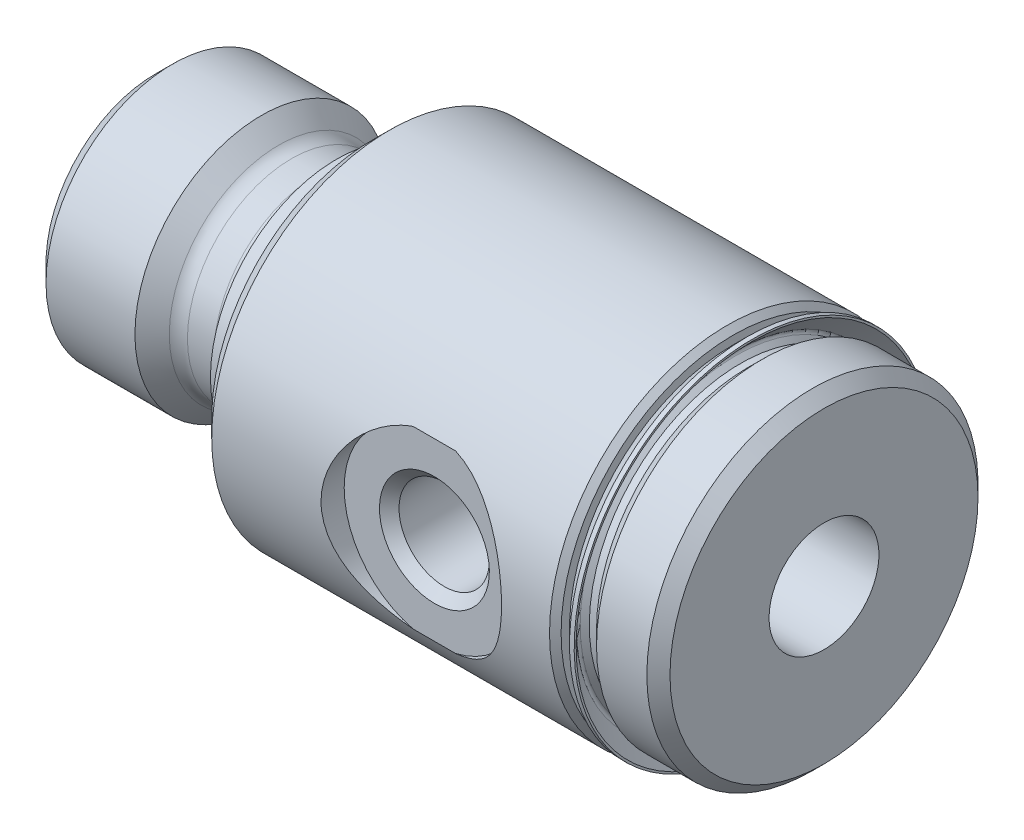
ISO-10303-21;
HEADER;
FILE_DESCRIPTION(('STEP AP214'),'2;1');
FILE_NAME('part.step','',(''),(''),'','','');
FILE_SCHEMA(('AUTOMOTIVE_DESIGN { 1 0 10303 214 1 1 1 1 }'));
ENDSEC;
DATA;
#1=APPLICATION_CONTEXT('core data for automotive mechanical design processes');
#2=APPLICATION_PROTOCOL_DEFINITION('international standard','automotive_design',2000,#1);
#3=PRODUCT_CONTEXT('',#1,'mechanical');
#4=PRODUCT('Part','Part','',(#3));
#5=PRODUCT_RELATED_PRODUCT_CATEGORY('part','',(#4));
#6=PRODUCT_DEFINITION_FORMATION('','',#4);
#7=PRODUCT_DEFINITION_CONTEXT('part definition',#1,'design');
#8=PRODUCT_DEFINITION('design','',#6,#7);
#9=PRODUCT_DEFINITION_SHAPE('','',#8);
#10=(LENGTH_UNIT() NAMED_UNIT(*) SI_UNIT(.MILLI.,.METRE.));
#11=(NAMED_UNIT(*) PLANE_ANGLE_UNIT() SI_UNIT($,.RADIAN.));
#12=(NAMED_UNIT(*) SI_UNIT($,.STERADIAN.) SOLID_ANGLE_UNIT());
#13=UNCERTAINTY_MEASURE_WITH_UNIT(LENGTH_MEASURE(1.E-05),#10,'distance_accuracy_value','');
#14=(GEOMETRIC_REPRESENTATION_CONTEXT(3) GLOBAL_UNCERTAINTY_ASSIGNED_CONTEXT((#13)) GLOBAL_UNIT_ASSIGNED_CONTEXT((#10,
#11,#12)) REPRESENTATION_CONTEXT('',''));
#15=CARTESIAN_POINT('',(0.,0.,0.));
#16=DIRECTION('',(0.,0.,1.));
#17=DIRECTION('',(1.,0.,0.));
#18=AXIS2_PLACEMENT_3D('',#15,#16,#17);
#19=CARTESIAN_POINT('',(29.3624,0.,0.));
#20=DIRECTION('',(-1.,0.,0.));
#21=DIRECTION('',(0.,0.,1.));
#22=AXIS2_PLACEMENT_3D('',#19,#20,#21);
#23=CYLINDRICAL_SURFACE('',#22,6.63575);
#24=CARTESIAN_POINT('',(25.6921000000149,-4.56834570173023E-13,0.));
#25=DIRECTION('',(-1.,0.,0.));
#26=DIRECTION('',(0.,-1.,0.));
#27=AXIS2_PLACEMENT_3D('',#24,#25,#26);
#28=CIRCLE('',#27,6.63574999992943);
#29=CARTESIAN_POINT('',(25.6921000000148,-6.63574999992989,0.));
#30=VERTEX_POINT('',#29);
#31=EDGE_CURVE('E502',#30,#30,#28,.T.);
#32=ORIENTED_EDGE('',*,*,#31,.F.);
#33=EDGE_LOOP('',(#32));
#34=FACE_BOUND('',#33,.T.);
#35=CARTESIAN_POINT('',(26.0095999999521,0.,0.));
#36=DIRECTION('',(1.,0.,0.));
#37=DIRECTION('',(0.,0.,-1.));
#38=AXIS2_PLACEMENT_3D('',#35,#36,#37);
#39=CIRCLE('',#38,6.63574999998673);
#40=CARTESIAN_POINT('',(26.0095999999521,0.,-6.63574999998673));
#41=VERTEX_POINT('',#40);
#42=EDGE_CURVE('E505',#41,#41,#39,.T.);
#43=ORIENTED_EDGE('',*,*,#42,.F.);
#44=EDGE_LOOP('',(#43));
#45=FACE_BOUND('',#44,.T.);
#46=ADVANCED_FACE('F17',(#34,#45),#23,.T.);
#47=CARTESIAN_POINT('',(25.4916397552166,-4.53196508098941E-13,0.));
#48=DIRECTION('',(-1.,0.,0.));
#49=DIRECTION('',(0.,-1.,0.));
#50=AXIS2_PLACEMENT_3D('',#47,#48,#49);
#51=CONICAL_SURFACE('',#50,6.83621024472768,0.785398163397468);
#52=ORIENTED_EDGE('',*,*,#31,.T.);
#53=EDGE_LOOP('',(#52));
#54=FACE_BOUND('',#53,.T.);
#55=CARTESIAN_POINT('',(25.4916397551572,-4.529023367679E-13,0.));
#56=DIRECTION('',(1.,0.,0.));
#57=DIRECTION('',(0.,1.,0.));
#58=AXIS2_PLACEMENT_3D('',#55,#56,#57);
#59=CIRCLE('',#58,6.83621024484324);
#60=CARTESIAN_POINT('',(25.4916397551573,6.83621024484279,0.));
#61=VERTEX_POINT('',#60);
#62=EDGE_CURVE('E509',#61,#61,#59,.T.);
#63=ORIENTED_EDGE('',*,*,#62,.T.);
#64=EDGE_LOOP('',(#63));
#65=FACE_BOUND('',#64,.T.);
#66=ADVANCED_FACE('F427',(#54,#65),#51,.T.);
#67=CARTESIAN_POINT('',(4.66029386444688,0.,0.));
#68=DIRECTION('',(-1.,0.,0.));
#69=DIRECTION('',(0.,0.,1.));
#70=AXIS2_PLACEMENT_3D('',#67,#68,#69);
#71=CONICAL_SURFACE('',#70,5.55624999992688,0.781588524280891);
#72=CARTESIAN_POINT('',(4.66029386437265,0.,0.));
#73=DIRECTION('',(-1.,0.,0.));
#74=DIRECTION('',(0.,0.,1.));
#75=AXIS2_PLACEMENT_3D('',#72,#73,#74);
#76=CIRCLE('',#75,5.55625);
#77=CARTESIAN_POINT('',(4.66029386437265,0.,5.55625));
#78=VERTEX_POINT('',#77);
#79=EDGE_CURVE('E506',#78,#78,#76,.T.);
#80=ORIENTED_EDGE('',*,*,#79,.F.);
#81=EDGE_LOOP('',(#80));
#82=FACE_BOUND('',#81,.T.);
#83=CARTESIAN_POINT('',(5.41810329137176,0.,0.));
#84=DIRECTION('',(1.,0.,0.));
#85=DIRECTION('',(0.,0.,-1.));
#86=AXIS2_PLACEMENT_3D('',#83,#84,#85);
#87=CIRCLE('',#86,4.80419264838054);
#88=CARTESIAN_POINT('',(5.41810329137176,0.,-4.80419264838054));
#89=VERTEX_POINT('',#88);
#90=EDGE_CURVE('E520',#89,#89,#87,.F.);
#91=ORIENTED_EDGE('',*,*,#90,.T.);
#92=EDGE_LOOP('',(#91));
#93=FACE_BOUND('',#92,.T.);
#94=ADVANCED_FACE('F417',(#82,#93),#71,.T.);
#95=CARTESIAN_POINT('',(26.6445999999974,0.,0.));
#96=DIRECTION('',(1.,0.,0.));
#97=DIRECTION('',(0.,0.,-1.));
#98=AXIS2_PLACEMENT_3D('',#95,#96,#97);
#99=CONICAL_SURFACE('',#98,7.27075000003197,0.785398163442207);
#100=ORIENTED_EDGE('',*,*,#42,.T.);
#101=EDGE_LOOP('',(#100));
#102=FACE_BOUND('',#101,.T.);
#103=CARTESIAN_POINT('',(26.6446,0.,0.));
#104=DIRECTION('',(-1.,0.,0.));
#105=DIRECTION('',(0.,0.,1.));
#106=AXIS2_PLACEMENT_3D('',#103,#104,#105);
#107=CIRCLE('',#106,7.27075);
#108=CARTESIAN_POINT('',(26.6446,0.,7.27075));
#109=VERTEX_POINT('',#108);
#110=EDGE_CURVE('E531',#109,#109,#107,.F.);
#111=ORIENTED_EDGE('',*,*,#110,.F.);
#112=EDGE_LOOP('',(#111));
#113=FACE_BOUND('',#112,.T.);
#114=ADVANCED_FACE('F407',(#102,#113),#99,.T.);
#115=CARTESIAN_POINT('',(9.525,0.,0.));
#116=DIRECTION('',(-1.,0.,0.));
#117=DIRECTION('',(0.,0.,1.));
#118=AXIS2_PLACEMENT_3D('',#115,#116,#117);
#119=CYLINDRICAL_SURFACE('',#118,5.55625);
#120=CARTESIAN_POINT('',(0.755649999973684,0.,0.));
#121=DIRECTION('',(1.,0.,0.));
#122=DIRECTION('',(0.,0.,-1.));
#123=AXIS2_PLACEMENT_3D('',#120,#121,#122);
#124=CIRCLE('',#123,5.55624999992688);
#125=CARTESIAN_POINT('',(0.755649999973684,0.,-5.55624999992688));
#126=VERTEX_POINT('',#125);
#127=EDGE_CURVE('E535',#126,#126,#124,.F.);
#128=ORIENTED_EDGE('',*,*,#127,.F.);
#129=EDGE_LOOP('',(#128));
#130=FACE_BOUND('',#129,.T.);
#131=ORIENTED_EDGE('',*,*,#79,.T.);
#132=EDGE_LOOP('',(#131));
#133=FACE_BOUND('',#132,.T.);
#134=ADVANCED_FACE('F397',(#130,#133),#119,.T.);
#135=CARTESIAN_POINT('',(25.5814423163679,-4.54497550705923E-13,0.));
#136=DIRECTION('',(1.,0.,0.));
#137=DIRECTION('',(0.,1.,0.));
#138=AXIS2_PLACEMENT_3D('',#135,#136,#137);
#139=TOROIDAL_SURFACE('',#138,6.9260128060539,0.126999999999996);
#140=CARTESIAN_POINT('',(25.4916397551571,-4.53273680903216E-13,0.));
#141=DIRECTION('',(1.,0.,0.));
#142=DIRECTION('',(0.,1.,0.));
#143=AXIS2_PLACEMENT_3D('',#140,#141,#142);
#144=CIRCLE('',#143,7.01581536726466);
#145=CARTESIAN_POINT('',(25.4916397551572,7.0158153672642,0.));
#146=VERTEX_POINT('',#145);
#147=EDGE_CURVE('E538',#146,#146,#144,.T.);
#148=ORIENTED_EDGE('',*,*,#147,.T.);
#149=EDGE_LOOP('',(#148));
#150=FACE_BOUND('',#149,.T.);
#151=ORIENTED_EDGE('',*,*,#62,.F.);
#152=EDGE_LOOP('',(#151));
#153=FACE_BOUND('',#152,.T.);
#154=ADVANCED_FACE('F387',(#150,#153),#139,.F.);
#155=CARTESIAN_POINT('',(5.9817,0.,0.));
#156=DIRECTION('',(1.,0.,0.));
#157=DIRECTION('',(0.,0.,-1.));
#158=AXIS2_PLACEMENT_3D('',#155,#156,#157);
#159=TOROIDAL_SURFACE('',#158,5.37209999999997,0.800099999999985);
#160=ORIENTED_EDGE('',*,*,#90,.F.);
#161=EDGE_LOOP('',(#160));
#162=FACE_BOUND('',#161,.T.);
#163=CARTESIAN_POINT('',(5.9817,0.,0.));
#164=DIRECTION('',(-1.,0.,0.));
#165=DIRECTION('',(0.,0.,1.));
#166=AXIS2_PLACEMENT_3D('',#163,#164,#165);
#167=CIRCLE('',#166,4.572);
#168=CARTESIAN_POINT('',(5.9817,0.,4.572));
#169=VERTEX_POINT('',#168);
#170=EDGE_CURVE('E547',#169,#169,#167,.F.);
#171=ORIENTED_EDGE('',*,*,#170,.F.);
#172=EDGE_LOOP('',(#171));
#173=FACE_BOUND('',#172,.T.);
#174=ADVANCED_FACE('F377',(#162,#173),#159,.F.);
#175=CARTESIAN_POINT('',(29.3624,0.,0.));
#176=DIRECTION('',(-1.,0.,0.));
#177=DIRECTION('',(0.,0.,1.));
#178=AXIS2_PLACEMENT_3D('',#175,#176,#177);
#179=CYLINDRICAL_SURFACE('',#178,7.27075);
#180=ORIENTED_EDGE('',*,*,#110,.T.);
#181=EDGE_LOOP('',(#180));
#182=FACE_BOUND('',#181,.T.);
#183=CARTESIAN_POINT('',(28.8544,0.,0.));
#184=DIRECTION('',(-1.,0.,0.));
#185=DIRECTION('',(0.,0.,1.));
#186=AXIS2_PLACEMENT_3D('',#183,#184,#185);
#187=CIRCLE('',#186,7.27075);
#188=CARTESIAN_POINT('',(28.8544,0.,7.27075));
#189=VERTEX_POINT('',#188);
#190=EDGE_CURVE('E552',#189,#189,#187,.F.);
#191=ORIENTED_EDGE('',*,*,#190,.F.);
#192=EDGE_LOOP('',(#191));
#193=FACE_BOUND('',#192,.T.);
#194=ADVANCED_FACE('F367',(#182,#193),#179,.T.);
#195=CARTESIAN_POINT('',(0.755649999916841,0.,0.));
#196=DIRECTION('',(1.,0.,0.));
#197=DIRECTION('',(0.,0.,-1.));
#198=AXIS2_PLACEMENT_3D('',#195,#196,#197);
#199=CONICAL_SURFACE('',#198,5.55624999987003,0.785398163435061);
#200=CARTESIAN_POINT('',(5.68435272810253E-11,0.,0.));
#201=DIRECTION('',(1.,0.,0.));
#202=DIRECTION('',(0.,0.,-1.));
#203=AXIS2_PLACEMENT_3D('',#200,#201,#202);
#204=CIRCLE('',#203,4.80059999995319);
#205=CARTESIAN_POINT('',(5.68435272810253E-11,0.,-4.80059999995319));
#206=VERTEX_POINT('',#205);
#207=EDGE_CURVE('E20',#206,#206,#204,.T.);
#208=ORIENTED_EDGE('',*,*,#207,.T.);
#209=EDGE_LOOP('',(#208));
#210=FACE_BOUND('',#209,.T.);
#211=ORIENTED_EDGE('',*,*,#127,.T.);
#212=EDGE_LOOP('',(#211));
#213=FACE_BOUND('',#212,.T.);
#214=ADVANCED_FACE('F357',(#210,#213),#199,.T.);
#215=CARTESIAN_POINT('',(26.2021561920187,-4.65773253299773E-13,0.));
#216=DIRECTION('',(1.,0.,0.));
#217=DIRECTION('',(0.,1.,0.));
#218=AXIS2_PLACEMENT_3D('',#215,#216,#217);
#219=CONICAL_SURFACE('',#218,7.72633180412633,0.785398163397471);
#220=ORIENTED_EDGE('',*,*,#147,.F.);
#221=EDGE_LOOP('',(#220));
#222=FACE_BOUND('',#221,.T.);
#223=CARTESIAN_POINT('',(26.2021561920187,-4.65773253299773E-13,0.));
#224=DIRECTION('',(1.,0.,0.));
#225=DIRECTION('',(0.,1.,0.));
#226=AXIS2_PLACEMENT_3D('',#223,#224,#225);
#227=CIRCLE('',#226,7.72633180412633);
#228=CARTESIAN_POINT('',(26.2021561920188,7.72633180412586,0.));
#229=VERTEX_POINT('',#228);
#230=EDGE_CURVE('E578',#229,#229,#227,.F.);
#231=ORIENTED_EDGE('',*,*,#230,.F.);
#232=EDGE_LOOP('',(#231));
#233=FACE_BOUND('',#232,.T.);
#234=ADVANCED_FACE('F347',(#222,#233),#219,.F.);
#235=CARTESIAN_POINT('',(9.525,0.,0.));
#236=DIRECTION('',(-1.,0.,0.));
#237=DIRECTION('',(0.,0.,1.));
#238=AXIS2_PLACEMENT_3D('',#235,#236,#237);
#239=CYLINDRICAL_SURFACE('',#238,4.572);
#240=ORIENTED_EDGE('',*,*,#170,.T.);
#241=EDGE_LOOP('',(#240));
#242=FACE_BOUND('',#241,.T.);
#243=CARTESIAN_POINT('',(7.1501,0.,0.));
#244=DIRECTION('',(1.,0.,0.));
#245=DIRECTION('',(0.,0.,-1.));
#246=AXIS2_PLACEMENT_3D('',#243,#244,#245);
#247=CIRCLE('',#246,4.572);
#248=CARTESIAN_POINT('',(7.1501,0.,-4.572));
#249=VERTEX_POINT('',#248);
#250=EDGE_CURVE('E575',#249,#249,#247,.F.);
#251=ORIENTED_EDGE('',*,*,#250,.T.);
#252=EDGE_LOOP('',(#251));
#253=FACE_BOUND('',#252,.T.);
#254=ADVANCED_FACE('F337',(#242,#253),#239,.T.);
#255=CARTESIAN_POINT('',(28.8544,0.,0.));
#256=DIRECTION('',(-1.,0.,0.));
#257=DIRECTION('',(0.,-1.,0.));
#258=AXIS2_PLACEMENT_3D('',#255,#256,#257);
#259=CONICAL_SURFACE('',#258,7.27075,0.785398163397447);
#260=ORIENTED_EDGE('',*,*,#190,.T.);
#261=EDGE_LOOP('',(#260));
#262=FACE_BOUND('',#261,.T.);
#263=CARTESIAN_POINT('',(29.3624,0.,0.));
#264=DIRECTION('',(-1.,0.,0.));
#265=DIRECTION('',(0.,-1.,0.));
#266=AXIS2_PLACEMENT_3D('',#263,#264,#265);
#267=CIRCLE('',#266,6.76275);
#268=CARTESIAN_POINT('',(29.3624,-6.76275,0.));
#269=VERTEX_POINT('',#268);
#270=EDGE_CURVE('E577',#269,#269,#267,.T.);
#271=ORIENTED_EDGE('',*,*,#270,.T.);
#272=EDGE_LOOP('',(#271));
#273=FACE_BOUND('',#272,.T.);
#274=ADVANCED_FACE('F327',(#262,#273),#259,.T.);
#275=CARTESIAN_POINT('',(0.,0.,0.));
#276=DIRECTION('',(1.,0.,0.));
#277=DIRECTION('',(0.,0.,-1.));
#278=AXIS2_PLACEMENT_3D('',#275,#276,#277);
#279=PLANE('',#278);
#280=CARTESIAN_POINT('',(-5.6843418860808E-11,0.,0.));
#281=DIRECTION('',(-1.,0.,0.));
#282=DIRECTION('',(0.,0.,1.));
#283=AXIS2_PLACEMENT_3D('',#280,#281,#282);
#284=CIRCLE('',#283,2.92100000001483);
#285=CARTESIAN_POINT('',(-5.6843418860808E-11,0.,2.92100000001483));
#286=VERTEX_POINT('',#285);
#287=EDGE_CURVE('E583',#286,#286,#284,.F.);
#288=ORIENTED_EDGE('',*,*,#287,.T.);
#289=EDGE_LOOP('',(#288));
#290=FACE_BOUND('',#289,.T.);
#291=ORIENTED_EDGE('',*,*,#207,.F.);
#292=EDGE_LOOP('',(#291));
#293=FACE_BOUND('',#292,.T.);
#294=ADVANCED_FACE('F317',(#290,#293),#279,.F.);
#295=CARTESIAN_POINT('',(26.2021561920189,7.72633180412578,0.));
#296=DIRECTION('',(1.,0.,0.));
#297=DIRECTION('',(0.,1.,0.));
#298=AXIS2_PLACEMENT_3D('',#295,#296,#297);
#299=PLANE('',#298);
#300=ORIENTED_EDGE('',*,*,#230,.T.);
#301=EDGE_LOOP('',(#300));
#302=FACE_BOUND('',#301,.T.);
#303=CARTESIAN_POINT('',(26.2021561920188,-4.6589498822447E-13,0.));
#304=DIRECTION('',(-1.,0.,0.));
#305=DIRECTION('',(0.,-1.,0.));
#306=AXIS2_PLACEMENT_3D('',#303,#304,#305);
#307=CIRCLE('',#306,7.81050000000046);
#308=CARTESIAN_POINT('',(26.2021561920186,-7.81050000000092,0.));
#309=VERTEX_POINT('',#308);
#310=EDGE_CURVE('E591',#309,#309,#307,.T.);
#311=ORIENTED_EDGE('',*,*,#310,.F.);
#312=EDGE_LOOP('',(#311));
#313=FACE_BOUND('',#312,.T.);
#314=ADVANCED_FACE('F307',(#302,#313),#299,.T.);
#315=CARTESIAN_POINT('',(7.1501,0.,0.));
#316=DIRECTION('',(1.,0.,0.));
#317=DIRECTION('',(0.,0.,-1.));
#318=AXIS2_PLACEMENT_3D('',#315,#316,#317);
#319=TOROIDAL_SURFACE('',#318,5.3721,0.800099999999995);
#320=ORIENTED_EDGE('',*,*,#250,.F.);
#321=EDGE_LOOP('',(#320));
#322=FACE_BOUND('',#321,.T.);
#323=CARTESIAN_POINT('',(7.95019999999999,0.,0.));
#324=DIRECTION('',(-1.,0.,0.));
#325=DIRECTION('',(0.,0.,-1.));
#326=AXIS2_PLACEMENT_3D('',#323,#324,#325);
#327=CIRCLE('',#326,5.3721);
#328=CARTESIAN_POINT('',(7.95019999999999,0.,-5.3721));
#329=VERTEX_POINT('',#328);
#330=EDGE_CURVE('E593',#329,#329,#327,.T.);
#331=ORIENTED_EDGE('',*,*,#330,.T.);
#332=EDGE_LOOP('',(#331));
#333=FACE_BOUND('',#332,.T.);
#334=ADVANCED_FACE('F297',(#322,#333),#319,.F.);
#335=CARTESIAN_POINT('',(29.3624,6.76275,0.));
#336=DIRECTION('',(-1.,0.,0.));
#337=DIRECTION('',(0.,0.,1.));
#338=AXIS2_PLACEMENT_3D('',#335,#336,#337);
#339=PLANE('',#338);
#340=ORIENTED_EDGE('',*,*,#270,.F.);
#341=EDGE_LOOP('',(#340));
#342=FACE_BOUND('',#341,.T.);
#343=CARTESIAN_POINT('',(29.3624,0.,0.));
#344=DIRECTION('',(-1.,0.,0.));
#345=DIRECTION('',(0.,0.,1.));
#346=AXIS2_PLACEMENT_3D('',#343,#344,#345);
#347=CIRCLE('',#346,2.413);
#348=CARTESIAN_POINT('',(29.3624,0.,2.413));
#349=VERTEX_POINT('',#348);
#350=EDGE_CURVE('E594',#349,#349,#347,.T.);
#351=ORIENTED_EDGE('',*,*,#350,.T.);
#352=EDGE_LOOP('',(#351));
#353=FACE_BOUND('',#352,.T.);
#354=ADVANCED_FACE('F287',(#342,#353),#339,.F.);
#355=CARTESIAN_POINT('',(-5.6843418860808E-11,0.,0.));
#356=DIRECTION('',(-1.,0.,0.));
#357=DIRECTION('',(0.,0.,1.));
#358=AXIS2_PLACEMENT_3D('',#355,#356,#357);
#359=CONICAL_SURFACE('',#358,2.92100000001483,0.785398163397448);
#360=ORIENTED_EDGE('',*,*,#287,.F.);
#361=EDGE_LOOP('',(#360));
#362=FACE_BOUND('',#361,.T.);
#363=CARTESIAN_POINT('',(0.508000000000002,0.,0.));
#364=DIRECTION('',(-1.,0.,0.));
#365=DIRECTION('',(0.,0.,1.));
#366=AXIS2_PLACEMENT_3D('',#363,#364,#365);
#367=CIRCLE('',#366,2.413);
#368=CARTESIAN_POINT('',(0.508000000000002,0.,2.413));
#369=VERTEX_POINT('',#368);
#370=EDGE_CURVE('E596',#369,#369,#367,.F.);
#371=ORIENTED_EDGE('',*,*,#370,.T.);
#372=EDGE_LOOP('',(#371));
#373=FACE_BOUND('',#372,.T.);
#374=ADVANCED_FACE('F277',(#362,#373),#359,.F.);
#375=CARTESIAN_POINT('',(26.0096,-4.62474503137856E-13,0.));
#376=DIRECTION('',(-1.,0.,0.));
#377=DIRECTION('',(0.,-1.,0.));
#378=AXIS2_PLACEMENT_3D('',#375,#376,#377);
#379=CYLINDRICAL_SURFACE('',#378,7.81050000000046);
#380=ORIENTED_EDGE('',*,*,#310,.T.);
#381=EDGE_LOOP('',(#380));
#382=FACE_BOUND('',#381,.T.);
#383=CARTESIAN_POINT('',(25.9989561920187,-4.6228543112681E-13,0.));
#384=DIRECTION('',(1.,0.,0.));
#385=DIRECTION('',(0.,1.,0.));
#386=AXIS2_PLACEMENT_3D('',#383,#384,#385);
#387=CIRCLE('',#386,7.81050000000052);
#388=CARTESIAN_POINT('',(25.9989561920189,7.81050000000005,0.));
#389=VERTEX_POINT('',#388);
#390=EDGE_CURVE('E142',#389,#389,#387,.F.);
#391=ORIENTED_EDGE('',*,*,#390,.F.);
#392=EDGE_LOOP('',(#391));
#393=FACE_BOUND('',#392,.T.);
#394=ADVANCED_FACE('F268',(#382,#393),#379,.T.);
#395=CARTESIAN_POINT('',(7.9502,5.3721,0.));
#396=DIRECTION('',(1.,0.,0.));
#397=DIRECTION('',(0.,0.,-1.));
#398=AXIS2_PLACEMENT_3D('',#395,#396,#397);
#399=PLANE('',#398);
#400=ORIENTED_EDGE('',*,*,#330,.F.);
#401=EDGE_LOOP('',(#400));
#402=FACE_BOUND('',#401,.T.);
#403=CARTESIAN_POINT('',(7.9502,0.,0.));
#404=DIRECTION('',(-1.,0.,0.));
#405=DIRECTION('',(0.,0.,1.));
#406=AXIS2_PLACEMENT_3D('',#403,#404,#405);
#407=CIRCLE('',#406,5.53085);
#408=CARTESIAN_POINT('',(7.9502,0.,5.53085));
#409=VERTEX_POINT('',#408);
#410=EDGE_CURVE('E114',#409,#409,#407,.F.);
#411=ORIENTED_EDGE('',*,*,#410,.F.);
#412=EDGE_LOOP('',(#411));
#413=FACE_BOUND('',#412,.T.);
#414=ADVANCED_FACE('F137',(#402,#413),#399,.F.);
#415=CARTESIAN_POINT('',(29.3624,0.,0.));
#416=DIRECTION('',(-1.,0.,0.));
#417=DIRECTION('',(0.,0.,1.));
#418=AXIS2_PLACEMENT_3D('',#415,#416,#417);
#419=CYLINDRICAL_SURFACE('',#418,2.413);
#420=CARTESIAN_POINT('',(21.0310143713552,0.103955335376314,2.41075975762231));
#421=CARTESIAN_POINT('',(21.0259220547741,0.200872609606509,2.40657417220141));
#422=CARTESIAN_POINT('',(21.0136870870141,0.297214471793428,2.39651612923512));
#423=CARTESIAN_POINT('',(20.9758293632797,0.485447279995661,2.36559649820063));
#424=CARTESIAN_POINT('',(20.9501898861363,0.577332509881809,2.34472141693752));
#425=CARTESIAN_POINT('',(20.8873895780533,0.753606125395761,2.29412312595698));
#426=CARTESIAN_POINT('',(20.8503121909007,0.838043288773209,2.26446405931317));
#427=CARTESIAN_POINT('',(20.7663116115838,0.998871132900379,2.19827292815395));
#428=CARTESIAN_POINT('',(20.7193847986757,1.07525883903787,2.16173833664138));
#429=CARTESIAN_POINT('',(20.5975607623024,1.24709185125857,2.06885781960111));
#430=CARTESIAN_POINT('',(20.5188365707143,1.33862084149902,2.01028547804166));
#431=CARTESIAN_POINT('',(20.347876538631,1.50500296320403,1.88895543247206));
#432=CARTESIAN_POINT('',(20.2556107755477,1.57981821461595,1.82618863178963));
#433=CARTESIAN_POINT('',(20.0732130450174,1.70249101414204,1.71173537743652));
#434=CARTESIAN_POINT('',(19.9848157539461,1.75270505991943,1.6597927073061));
#435=CARTESIAN_POINT('',(19.7984780175411,1.83998471399317,1.5624512961401));
#436=CARTESIAN_POINT('',(19.7005670482434,1.87708938071046,1.51703335925293));
#437=CARTESIAN_POINT('',(19.53337252076,1.92510785096747,1.45514945838594));
#438=CARTESIAN_POINT('',(19.4671029576112,1.94062608921284,1.43421118887267));
#439=CARTESIAN_POINT('',(19.3313207802258,1.96489588862553,1.40077982649907));
#440=CARTESIAN_POINT('',(19.261816397314,1.9736637249573,1.38826643054676));
#441=CARTESIAN_POINT('',(19.1204980428815,1.9837592012169,1.37381250178847));
#442=CARTESIAN_POINT('',(19.0486693128378,1.98502195705552,1.37196417629038));
#443=CARTESIAN_POINT('',(18.9058669150705,1.97979050599544,1.3794969114073));
#444=CARTESIAN_POINT('',(18.8348941750899,1.97328853425192,1.38888921283928));
#445=CARTESIAN_POINT('',(18.6829334137233,1.95126890066192,1.41969243342628));
#446=CARTESIAN_POINT('',(18.60256824325,1.93428717441464,1.44302949669726));
#447=CARTESIAN_POINT('',(18.4472517263437,1.89167932954791,1.49844228294387));
#448=CARTESIAN_POINT('',(18.3723186181345,1.86602559170149,1.53054586254473));
#449=CARTESIAN_POINT('',(18.2442859648394,1.81374979663411,1.59189381272925));
#450=CARTESIAN_POINT('',(18.190069388982,1.78864646958831,1.62015428160253));
#451=CARTESIAN_POINT('',(18.0848132180982,1.73411438717136,1.67839569610793));
#452=CARTESIAN_POINT('',(18.0337752680809,1.70468341819861,1.70837751740432));
#453=CARTESIAN_POINT('',(17.8852051693959,1.61006026602519,1.79941909307218));
#454=CARTESIAN_POINT('',(17.7922553285308,1.53855386624587,1.86155491985082));
#455=CARTESIAN_POINT('',(17.61660825977,1.37669822184797,1.98442917024464));
#456=CARTESIAN_POINT('',(17.5343060350347,1.28584459076616,2.04506852702772));
#457=CARTESIAN_POINT('',(17.3859795307442,1.08698372284249,2.1573072604153));
#458=CARTESIAN_POINT('',(17.31990762988,0.979028235628096,2.20893295185209));
#459=CARTESIAN_POINT('',(17.2251989798292,0.78312109635982,2.2840088212325));
#460=CARTESIAN_POINT('',(17.1912939234154,0.699158948236276,2.31124652281514));
#461=CARTESIAN_POINT('',(17.134865365481,0.525187355206468,2.35686360523858));
#462=CARTESIAN_POINT('',(17.1123331710471,0.43518258881645,2.37524975131929));
#463=CARTESIAN_POINT('',(17.0799567207605,0.250892803662844,2.401734311239));
#464=CARTESIAN_POINT('',(17.07018107245,0.156587440638896,2.40977709284121));
#465=CARTESIAN_POINT('',(17.0642723461511,-0.032741310639646,2.41463355916974));
#466=CARTESIAN_POINT('',(17.0681368323928,-0.127764567673314,2.41144924876002));
#467=CARTESIAN_POINT('',(17.0883166391177,-0.307433407819269,2.3948941642485));
#468=CARTESIAN_POINT('',(17.103568971306,-0.392284503432923,2.38239321491692));
#469=CARTESIAN_POINT('',(17.1443774637442,-0.55775806655909,2.34917049245205));
#470=CARTESIAN_POINT('',(17.1699350845494,-0.638379932837097,2.32844755403329));
#471=CARTESIAN_POINT('',(17.2319378645636,-0.798554043559612,2.27866876953395));
#472=CARTESIAN_POINT('',(17.2689416152053,-0.877755504065922,2.24918953528265));
#473=CARTESIAN_POINT('',(17.3516855297561,-1.02877592825032,2.1842531359303));
#474=CARTESIAN_POINT('',(17.3974319117166,-1.10058958121164,2.1487917182189));
#475=CARTESIAN_POINT('',(17.5193376734454,-1.26784056931656,2.05621676239119));
#476=CARTESIAN_POINT('',(17.5997741280542,-1.35882989074283,1.99667781514329));
#477=CARTESIAN_POINT('',(17.7742408322147,-1.52386040669408,1.87377082237429));
#478=CARTESIAN_POINT('',(17.8683011722689,-1.59786312315858,1.81039448657162));
#479=CARTESIAN_POINT('',(18.0511633879086,-1.71674476127811,1.69729892744318));
#480=CARTESIAN_POINT('',(18.1378762492941,-1.76446722032475,1.64717097529275));
#481=CARTESIAN_POINT('',(18.3203654337867,-1.84739204611899,1.55357094429548));
#482=CARTESIAN_POINT('',(18.4161135844412,-1.88263180098206,1.51007921530998));
#483=CARTESIAN_POINT('',(18.5808279584652,-1.92861219642245,1.45048558194581));
#484=CARTESIAN_POINT('',(18.6470428227305,-1.94360577480251,1.43015837446201));
#485=CARTESIAN_POINT('',(18.782610108766,-1.96683313222655,1.39804662641904));
#486=CARTESIAN_POINT('',(18.8519546873491,-1.97508291608265,1.38624186766173));
#487=CARTESIAN_POINT('',(18.9927444336789,-1.98417447761199,1.37320682675961));
#488=CARTESIAN_POINT('',(19.0642020102913,-1.98495614117819,1.37206235568919));
#489=CARTESIAN_POINT('',(19.2061302447807,-1.97886581562626,1.38082548718729));
#490=CARTESIAN_POINT('',(19.2765996956444,-1.97198517320919,1.39074558536476));
#491=CARTESIAN_POINT('',(19.4287578975603,-1.94906738902211,1.42272761598248));
#492=CARTESIAN_POINT('',(19.5097439626048,-1.93142773876677,1.44688031510776));
#493=CARTESIAN_POINT('',(19.6661564028341,-1.88738571487313,1.50387208554013));
#494=CARTESIAN_POINT('',(19.7415640949195,-1.86095539179886,1.53673879404573));
#495=CARTESIAN_POINT('',(19.8701763336389,-1.80726795961134,1.5992651771468));
#496=CARTESIAN_POINT('',(19.924528715529,-1.78156747411496,1.62795285017205));
#497=CARTESIAN_POINT('',(20.0300164757212,-1.72579046110531,1.68697042550035));
#498=CARTESIAN_POINT('',(20.0811502188312,-1.69571173457401,1.71730114820767));
#499=CARTESIAN_POINT('',(20.229938535041,-1.59905806626885,1.8092717501775));
#500=CARTESIAN_POINT('',(20.3229455404704,-1.52608034787278,1.87187181531126));
#501=CARTESIAN_POINT('',(20.4981665611085,-1.36121194716931,1.99514640075315));
#502=CARTESIAN_POINT('',(20.5800162340243,-1.26885897649563,2.05572157171786));
#503=CARTESIAN_POINT('',(20.7270592810989,-1.06685607033735,2.16739478196378));
#504=CARTESIAN_POINT('',(20.7923016711983,-0.9572586180892,2.2185205855097));
#505=CARTESIAN_POINT('',(20.8847360086845,-0.759521875392971,2.29196237559204));
#506=CARTESIAN_POINT('',(20.9174441707785,-0.675434030757377,2.31828499242314));
#507=CARTESIAN_POINT('',(20.9714524589004,-0.501494171856778,2.36200518405794));
#508=CARTESIAN_POINT('',(20.9927703631915,-0.411651387024428,2.3794166658339));
#509=CARTESIAN_POINT('',(21.0191176873506,-0.250556051489444,2.40098504663548));
#510=CARTESIAN_POINT('',(21.0268296860413,-0.180021876298218,2.40732115808298));
#511=CARTESIAN_POINT('',(21.0346423224749,-0.038237319558706,2.41374085395218));
#512=CARTESIAN_POINT('',(21.0347418802825,0.033013162174115,2.41382355123641));
#513=CARTESIAN_POINT('',(21.0310143713552,0.103955335376314,2.41075975762231));
#514=B_SPLINE_CURVE_WITH_KNOTS('',3,(#420,#421,#422,#423,#424,#425,#426,#427,#428,#429,#430,
#431,#432,#433,#434,#435,#436,#437,#438,#439,#440,#441,#442,#443,#444,#445,#446,#447,#448,#449,
#450,#451,#452,#453,#454,#455,#456,#457,#458,#459,#460,#461,#462,#463,#464,#465,#466,#467,#468,
#469,#470,#471,#472,#473,#474,#475,#476,#477,#478,#479,#480,#481,#482,#483,#484,#485,#486,#487,
#488,#489,#490,#491,#492,#493,#494,#495,#496,#497,#498,#499,#500,#501,#502,#503,#504,#505,#506,
#507,#508,#509,#510,#511,#512,#513),.UNSPECIFIED.,.T.,.F.,(4,2,2,2,2,2,2,2,2,2,2,2,2,2,2,2,2,2,
2,2,2,2,2,2,2,2,2,2,2,2,2,2,2,2,2,2,2,2,2,2,2,2,2,2,2,2,4),(0.,0.291112139380865,
0.582588289914406,0.871986384618488,1.16149105176431,1.56195037480361,1.96330829406499,
2.30479714438813,2.64525979943978,2.85819693715754,3.07061906335899,3.28487501349999,
3.49934540236508,3.75410099119566,4.00967570975536,4.20770246542052,4.40583086699329,
4.80222502227159,5.2106052741923,5.61777259042779,5.90032763997097,6.18266638861118,
6.46651744334318,6.75031781229454,7.01049888177331,7.27071683935539,7.5464596834789,
7.82239937994102,8.2260422282761,8.63059057868722,8.96249042618527,9.29338759195652,
9.5052883183263,9.71668467600056,9.92978123391486,10.1431186931894,10.4006827003116,
10.6590735729024,10.8586685533932,11.0583641307262,11.4578793541579,11.8683108184885,
12.2775164800857,12.5583747517143,12.8387933609932,13.0518534020901,13.2649436687867),.UNSPECIFIED.);
#515=CARTESIAN_POINT('',(21.0310143713552,0.103955335376314,2.41075975762231));
#516=VERTEX_POINT('',#515);
#517=EDGE_CURVE('E107',#516,#516,#514,.T.);
#518=ORIENTED_EDGE('',*,*,#517,.T.);
#519=EDGE_LOOP('',(#518));
#520=FACE_BOUND('',#519,.T.);
#521=ORIENTED_EDGE('',*,*,#370,.F.);
#522=EDGE_LOOP('',(#521));
#523=FACE_BOUND('',#522,.T.);
#524=ORIENTED_EDGE('',*,*,#350,.F.);
#525=EDGE_LOOP('',(#524));
#526=FACE_BOUND('',#525,.T.);
#527=ADVANCED_FACE('F116',(#520,#523,#526),#419,.F.);
#528=CARTESIAN_POINT('',(25.9989561920187,-4.62303806347819E-13,0.));
#529=DIRECTION('',(1.,0.,0.));
#530=DIRECTION('',(0.,1.,0.));
#531=AXIS2_PLACEMENT_3D('',#528,#529,#530);
#532=CONICAL_SURFACE('',#531,7.81050000000052,0.785398163397461);
#533=ORIENTED_EDGE('',*,*,#390,.T.);
#534=EDGE_LOOP('',(#533));
#535=FACE_BOUND('',#534,.T.);
#536=CARTESIAN_POINT('',(25.3745999999998,-4.5107150203478E-13,0.));
#537=DIRECTION('',(1.,0.,0.));
#538=DIRECTION('',(0.,1.,0.));
#539=AXIS2_PLACEMENT_3D('',#536,#537,#538);
#540=CIRCLE('',#539,7.18614380798163);
#541=CARTESIAN_POINT('',(25.3746,7.18614380798117,0.));
#542=VERTEX_POINT('',#541);
#543=EDGE_CURVE('E104',#542,#542,#540,.T.);
#544=ORIENTED_EDGE('',*,*,#543,.T.);
#545=EDGE_LOOP('',(#544));
#546=FACE_BOUND('',#545,.T.);
#547=ADVANCED_FACE('F130',(#535,#546),#532,.T.);
#548=CARTESIAN_POINT('',(9.525,0.,0.));
#549=DIRECTION('',(-1.,0.,0.));
#550=DIRECTION('',(0.,0.,1.));
#551=AXIS2_PLACEMENT_3D('',#548,#549,#550);
#552=CYLINDRICAL_SURFACE('',#551,5.53085);
#553=ORIENTED_EDGE('',*,*,#410,.T.);
#554=EDGE_LOOP('',(#553));
#555=FACE_BOUND('',#554,.T.);
#556=CARTESIAN_POINT('',(9.525,0.,0.));
#557=DIRECTION('',(-1.,0.,0.));
#558=DIRECTION('',(0.,0.,1.));
#559=AXIS2_PLACEMENT_3D('',#556,#557,#558);
#560=CIRCLE('',#559,5.53085);
#561=CARTESIAN_POINT('',(9.525,0.,5.53085));
#562=VERTEX_POINT('',#561);
#563=EDGE_CURVE('E101',#562,#562,#560,.T.);
#564=ORIENTED_EDGE('',*,*,#563,.T.);
#565=EDGE_LOOP('',(#564));
#566=FACE_BOUND('',#565,.T.);
#567=ADVANCED_FACE('F126',(#555,#566),#552,.T.);
#568=CARTESIAN_POINT('',(19.05,0.,7.8105));
#569=DIRECTION('',(0.,0.,-1.));
#570=DIRECTION('',(-1.,0.,0.));
#571=AXIS2_PLACEMENT_3D('',#568,#569,#570);
#572=CYLINDRICAL_SURFACE('',#571,1.98374);
#573=ORIENTED_EDGE('',*,*,#517,.F.);
#574=EDGE_LOOP('',(#573));
#575=FACE_BOUND('',#574,.T.);
#576=CARTESIAN_POINT('',(19.05,0.,6.36523999997962));
#577=DIRECTION('',(0.,0.,1.));
#578=DIRECTION('',(1.,0.,0.));
#579=AXIS2_PLACEMENT_3D('',#576,#577,#578);
#580=CIRCLE('',#579,1.98373999995029);
#581=CARTESIAN_POINT('',(21.0337399999503,0.,6.36523999997962));
#582=VERTEX_POINT('',#581);
#583=EDGE_CURVE('E100',#582,#582,#580,.T.);
#584=ORIENTED_EDGE('',*,*,#583,.T.);
#585=EDGE_LOOP('',(#584));
#586=FACE_BOUND('',#585,.T.);
#587=ADVANCED_FACE('F120',(#575,#586),#572,.F.);
#588=CARTESIAN_POINT('',(25.3746,7.5565,0.));
#589=DIRECTION('',(-1.,0.,0.));
#590=DIRECTION('',(0.,0.,1.));
#591=AXIS2_PLACEMENT_3D('',#588,#589,#590);
#592=PLANE('',#591);
#593=CARTESIAN_POINT('',(25.3746,0.,0.));
#594=DIRECTION('',(-1.,0.,0.));
#595=DIRECTION('',(0.,-1.,0.));
#596=AXIS2_PLACEMENT_3D('',#593,#594,#595);
#597=CIRCLE('',#596,7.5565);
#598=CARTESIAN_POINT('',(25.3746,-7.5565,0.));
#599=VERTEX_POINT('',#598);
#600=EDGE_CURVE('E97',#599,#599,#597,.T.);
#601=ORIENTED_EDGE('',*,*,#600,.F.);
#602=EDGE_LOOP('',(#601));
#603=FACE_BOUND('',#602,.T.);
#604=ORIENTED_EDGE('',*,*,#543,.F.);
#605=EDGE_LOOP('',(#604));
#606=FACE_BOUND('',#605,.T.);
#607=ADVANCED_FACE('F125',(#603,#606),#592,.F.);
#608=CARTESIAN_POINT('',(9.525,0.,0.));
#609=DIRECTION('',(1.,0.,0.));
#610=DIRECTION('',(0.,0.,-1.));
#611=AXIS2_PLACEMENT_3D('',#608,#609,#610);
#612=PLANE('',#611);
#613=ORIENTED_EDGE('',*,*,#563,.F.);
#614=EDGE_LOOP('',(#613));
#615=FACE_BOUND('',#614,.T.);
#616=CARTESIAN_POINT('',(9.525,0.,0.));
#617=DIRECTION('',(1.,0.,0.));
#618=DIRECTION('',(0.,0.,-1.));
#619=AXIS2_PLACEMENT_3D('',#616,#617,#618);
#620=CIRCLE('',#619,7.0485);
#621=CARTESIAN_POINT('',(9.525,0.,-7.0485));
#622=VERTEX_POINT('',#621);
#623=EDGE_CURVE('E55',#622,#622,#620,.T.);
#624=ORIENTED_EDGE('',*,*,#623,.F.);
#625=EDGE_LOOP('',(#624));
#626=FACE_BOUND('',#625,.T.);
#627=ADVANCED_FACE('F146',(#615,#626),#612,.F.);
#628=CARTESIAN_POINT('',(19.05,0.,6.79449999995541));
#629=DIRECTION('',(0.,0.,1.));
#630=DIRECTION('',(0.,-1.,0.));
#631=AXIS2_PLACEMENT_3D('',#628,#629,#630);
#632=CONICAL_SURFACE('',#631,2.41299999992607,0.785398163397448);
#633=ORIENTED_EDGE('',*,*,#583,.F.);
#634=EDGE_LOOP('',(#633));
#635=FACE_BOUND('',#634,.T.);
#636=CARTESIAN_POINT('',(19.05,0.,6.79450000001225));
#637=DIRECTION('',(0.,0.,1.));
#638=DIRECTION('',(0.,-1.,0.));
#639=AXIS2_PLACEMENT_3D('',#636,#637,#638);
#640=CIRCLE('',#639,2.41299999998291);
#641=CARTESIAN_POINT('',(19.05,-2.41299999998291,6.79450000001225));
#642=VERTEX_POINT('',#641);
#643=EDGE_CURVE('E88',#642,#642,#640,.F.);
#644=ORIENTED_EDGE('',*,*,#643,.F.);
#645=EDGE_LOOP('',(#644));
#646=FACE_BOUND('',#645,.T.);
#647=ADVANCED_FACE('F151',(#635,#646),#632,.F.);
#648=CARTESIAN_POINT('',(25.1206,0.,0.));
#649=DIRECTION('',(-1.,0.,0.));
#650=DIRECTION('',(0.,-1.,0.));
#651=AXIS2_PLACEMENT_3D('',#648,#649,#650);
#652=CONICAL_SURFACE('',#651,7.8105,0.785398163397448);
#653=CARTESIAN_POINT('',(25.1206,0.,0.));
#654=DIRECTION('',(-1.,0.,0.));
#655=DIRECTION('',(0.,0.,1.));
#656=AXIS2_PLACEMENT_3D('',#653,#654,#655);
#657=CIRCLE('',#656,7.8105);
#658=CARTESIAN_POINT('',(25.1206,0.,7.8105));
#659=VERTEX_POINT('',#658);
#660=EDGE_CURVE('E90',#659,#659,#657,.T.);
#661=ORIENTED_EDGE('',*,*,#660,.F.);
#662=EDGE_LOOP('',(#661));
#663=FACE_BOUND('',#662,.T.);
#664=ORIENTED_EDGE('',*,*,#600,.T.);
#665=EDGE_LOOP('',(#664));
#666=FACE_BOUND('',#665,.T.);
#667=ADVANCED_FACE('F155',(#663,#666),#652,.T.);
#668=CARTESIAN_POINT('',(10.287,0.,0.));
#669=DIRECTION('',(1.,0.,0.));
#670=DIRECTION('',(0.,0.,-1.));
#671=AXIS2_PLACEMENT_3D('',#668,#669,#670);
#672=CONICAL_SURFACE('',#671,7.8105,0.785398163397447);
#673=ORIENTED_EDGE('',*,*,#623,.T.);
#674=EDGE_LOOP('',(#673));
#675=FACE_BOUND('',#674,.T.);
#676=CARTESIAN_POINT('',(10.287,0.,0.));
#677=DIRECTION('',(-1.,0.,0.));
#678=DIRECTION('',(0.,0.,1.));
#679=AXIS2_PLACEMENT_3D('',#676,#677,#678);
#680=CIRCLE('',#679,7.8105);
#681=CARTESIAN_POINT('',(10.287,0.,7.8105));
#682=VERTEX_POINT('',#681);
#683=EDGE_CURVE('E50',#682,#682,#680,.F.);
#684=ORIENTED_EDGE('',*,*,#683,.F.);
#685=EDGE_LOOP('',(#684));
#686=FACE_BOUND('',#685,.T.);
#687=ADVANCED_FACE('F157',(#675,#686),#672,.T.);
#688=CARTESIAN_POINT('',(19.05,0.,7.8105));
#689=DIRECTION('',(0.,0.,-1.));
#690=DIRECTION('',(-1.,0.,0.));
#691=AXIS2_PLACEMENT_3D('',#688,#689,#690);
#692=CYLINDRICAL_SURFACE('',#691,3.9624);
#693=CARTESIAN_POINT('',(19.9784038776308,3.85210072557819,6.7945));
#694=CARTESIAN_POINT('',(20.0871441476983,3.82589544686893,6.80934420874089));
#695=CARTESIAN_POINT('',(20.1943778263773,3.79517548526654,6.82657379028904));
#696=CARTESIAN_POINT('',(20.4051519641891,3.72511745285641,6.86505997155541));
#697=CARTESIAN_POINT('',(20.5086954076075,3.68578653845436,6.88631322530072));
#698=CARTESIAN_POINT('',(20.8121889417393,3.55578060620909,6.95484648081365));
#699=CARTESIAN_POINT('',(21.0059222633617,3.45286628823123,7.00703655483552));
#700=CARTESIAN_POINT('',(21.3718946574185,3.21817091332426,7.11786712811991));
#701=CARTESIAN_POINT('',(21.5441915172288,3.08647022469434,7.17648944675929));
#702=CARTESIAN_POINT('',(21.8652206001147,2.79677701729547,7.29427566912562));
#703=CARTESIAN_POINT('',(22.0139229679327,2.63875169860475,7.35344016037897));
#704=CARTESIAN_POINT('',(22.2930004460401,2.28839067605302,7.47015651935842));
#705=CARTESIAN_POINT('',(22.4216119254221,2.0945133665992,7.52736735939915));
#706=CARTESIAN_POINT('',(22.5882521642072,1.78745629875585,7.60395461709459));
#707=CARTESIAN_POINT('',(22.6394307437685,1.68236335543616,7.62795130954219));
#708=CARTESIAN_POINT('',(22.7325253651758,1.467415909354,7.67219678193279));
#709=CARTESIAN_POINT('',(22.7744464910334,1.35756405994037,7.69244761802928));
#710=CARTESIAN_POINT('',(22.8463423582829,1.14048258055078,7.72752147938978));
#711=CARTESIAN_POINT('',(22.8768734567333,1.03347688643543,7.7425931442856));
#712=CARTESIAN_POINT('',(22.9288925199877,0.816827347829267,7.76843568198634));
#713=CARTESIAN_POINT('',(22.9503849783784,0.707184842968011,7.77920869174365));
#714=CARTESIAN_POINT('',(22.9840506327867,0.486160747751188,7.79614258259886));
#715=CARTESIAN_POINT('',(22.9962268423637,0.374779731663946,7.80230495510138));
#716=CARTESIAN_POINT('',(23.0110970240145,0.151228170032667,7.80983636785463));
#717=CARTESIAN_POINT('',(23.0137917464325,0.0390576876692586,7.81120578740914));
#718=CARTESIAN_POINT('',(23.0098626942883,-0.174230727152885,7.80921306572696));
#719=CARTESIAN_POINT('',(23.0041134263872,-0.275370230556358,7.80629495337319));
#720=CARTESIAN_POINT('',(22.9849140365282,-0.476760563041051,7.79658748131316));
#721=CARTESIAN_POINT('',(22.971461443328,-0.577011096453566,7.78979687930726));
#722=CARTESIAN_POINT('',(22.9370107815293,-0.77584386949125,7.77251093312911));
#723=CARTESIAN_POINT('',(22.9160156536495,-0.87442674364788,7.76201703284431));
#724=CARTESIAN_POINT('',(22.866711471725,-1.06932194629943,7.73757915700026));
#725=CARTESIAN_POINT('',(22.8383996096475,-1.16563338753836,7.72363385694216));
#726=CARTESIAN_POINT('',(22.7429622417522,-1.45000298576464,7.67711751193974));
#727=CARTESIAN_POINT('',(22.6652689288464,-1.63387127553528,7.63983166466624));
#728=CARTESIAN_POINT('',(22.4844105074451,-1.98613907629759,7.55592978822106));
#729=CARTESIAN_POINT('',(22.3812378745803,-2.15453399761335,7.50931100368502));
#730=CARTESIAN_POINT('',(22.1415879893032,-2.48767198577415,7.40597608662514));
#731=CARTESIAN_POINT('',(22.0029338281294,-2.65068693044985,7.34872708336746));
#732=CARTESIAN_POINT('',(21.7014854689175,-2.95225332865383,7.23286067534091));
#733=CARTESIAN_POINT('',(21.5386683630018,-3.09078129100682,7.17424201698428));
#734=CARTESIAN_POINT('',(21.1919493818625,-3.34037993308468,7.0614808768916));
#735=CARTESIAN_POINT('',(21.0080772310669,-3.45148863901217,7.00733226609807));
#736=CARTESIAN_POINT('',(20.7193479654856,-3.59519821350267,6.93407158259833));
#737=CARTESIAN_POINT('',(20.6210409964459,-3.63924791955856,6.91099474451808));
#738=CARTESIAN_POINT('',(20.4205507786715,-3.71938598222266,6.86819783346444));
#739=CARTESIAN_POINT('',(20.3183702846579,-3.7554798767184,6.84847542773293));
#740=CARTESIAN_POINT('',(20.1756487853758,-3.79936734605261,6.8241412914012));
#741=CARTESIAN_POINT('',(20.1364755120193,-3.81075500048537,6.81778630014991));
#742=CARTESIAN_POINT('',(20.0577343126525,-3.83232947195563,6.8056824487551));
#743=CARTESIAN_POINT('',(20.0181666526235,-3.84251704581509,6.79993320684443));
#744=CARTESIAN_POINT('',(19.9784038776308,-3.85210072557826,6.79450000000023));
#745=B_SPLINE_CURVE_WITH_KNOTS('',3,(#693,#694,#695,#696,#697,#698,#699,#700,#701,#702,#703,
#704,#705,#706,#707,#708,#709,#710,#711,#712,#713,#714,#715,#716,#717,#718,#719,#720,#721,#722,
#723,#724,#725,#726,#727,#728,#729,#730,#731,#732,#733,#734,#735,#736,#737,#738,#739,#740,#741,
#742,#743,#744),.UNSPECIFIED.,.F.,.F.,(4,2,2,2,2,2,2,2,2,2,2,2,2,2,2,2,2,2,2,2,2,2,2,2,2,4),(0.,
0.338221009541503,0.67616198963787,1.34921263131612,2.02040766224254,2.6924453300858,
3.40716181306005,3.76473320700904,4.12210773870362,4.45852719349784,4.7947791980813,
5.13092238801829,5.46703897572,5.77070634470169,6.07447118541031,6.37811772116266,
6.68188096457572,7.28827462636846,7.89484757855808,8.55664209811417,9.21906809364816,
9.88057017933557,10.210756651782,10.5407125568174,10.664555135566,10.7883191909823),.UNSPECIFIED.);
#746=CARTESIAN_POINT('',(19.9784038776308,3.85210072557819,6.7945));
#747=VERTEX_POINT('',#746);
#748=CARTESIAN_POINT('',(19.9784038776308,-3.85210072557819,6.7945));
#749=VERTEX_POINT('',#748);
#750=EDGE_CURVE('E45',#747,#749,#745,.T.);
#751=ORIENTED_EDGE('',*,*,#750,.F.);
#752=CARTESIAN_POINT('',(19.05,0.,6.7945));
#753=DIRECTION('',(0.,0.,-1.));
#754=DIRECTION('',(-1.,0.,0.));
#755=AXIS2_PLACEMENT_3D('',#752,#753,#754);
#756=CIRCLE('',#755,3.9624);
#757=EDGE_CURVE('E42',#749,#747,#756,.F.);
#758=ORIENTED_EDGE('',*,*,#757,.F.);
#759=EDGE_LOOP('',(#751,#758));
#760=FACE_BOUND('',#759,.T.);
#761=ADVANCED_FACE('F46',(#760),#692,.F.);
#762=CARTESIAN_POINT('',(19.05,0.,7.8105));
#763=DIRECTION('',(0.,0.,-1.));
#764=DIRECTION('',(-1.,0.,0.));
#765=AXIS2_PLACEMENT_3D('',#762,#763,#764);
#766=CYLINDRICAL_SURFACE('',#765,3.9624);
#767=CARTESIAN_POINT('',(18.1215961223692,-3.85210072557819,6.7945));
#768=CARTESIAN_POINT('',(18.0128558523017,-3.82589544686893,6.80934420874089));
#769=CARTESIAN_POINT('',(17.9056221736227,-3.79517548526654,6.82657379028904));
#770=CARTESIAN_POINT('',(17.6948480358109,-3.72511745285641,6.86505997155541));
#771=CARTESIAN_POINT('',(17.5913045923925,-3.68578653845436,6.88631322530072));
#772=CARTESIAN_POINT('',(17.2878110582607,-3.55578060620909,6.95484648081365));
#773=CARTESIAN_POINT('',(17.0940777366383,-3.45286628823123,7.00703655483552));
#774=CARTESIAN_POINT('',(16.7281053425815,-3.21817091332426,7.11786712811991));
#775=CARTESIAN_POINT('',(16.5558084827712,-3.08647022469434,7.17648944675929));
#776=CARTESIAN_POINT('',(16.2347793998853,-2.79677701729547,7.29427566912562));
#777=CARTESIAN_POINT('',(16.0860770320673,-2.63875169860475,7.35344016037897));
#778=CARTESIAN_POINT('',(15.8069995539599,-2.28839067605303,7.47015651935842));
#779=CARTESIAN_POINT('',(15.6783880745779,-2.09451336659921,7.52736735939915));
#780=CARTESIAN_POINT('',(15.5117478357928,-1.78745629875585,7.60395461709459));
#781=CARTESIAN_POINT('',(15.4605692562315,-1.68236335543616,7.62795130954219));
#782=CARTESIAN_POINT('',(15.3674746348242,-1.46741590935401,7.67219678193279));
#783=CARTESIAN_POINT('',(15.3255535089666,-1.35756405994037,7.69244761802928));
#784=CARTESIAN_POINT('',(15.2536576417171,-1.14048258055079,7.72752147938978));
#785=CARTESIAN_POINT('',(15.2231265432667,-1.03347688643544,7.7425931442856));
#786=CARTESIAN_POINT('',(15.1711074800123,-0.816827347829273,7.76843568198634));
#787=CARTESIAN_POINT('',(15.1496150216216,-0.707184842968017,7.77920869174365));
#788=CARTESIAN_POINT('',(15.1159493672133,-0.486160747751194,7.79614258259886));
#789=CARTESIAN_POINT('',(15.1037731576363,-0.374779731663951,7.80230495510138));
#790=CARTESIAN_POINT('',(15.0889029759855,-0.151228170032672,7.80983636785463));
#791=CARTESIAN_POINT('',(15.0862082535675,-0.0390576876692631,7.81120578740914));
#792=CARTESIAN_POINT('',(15.0901373057117,0.17423072715288,7.80921306572696));
#793=CARTESIAN_POINT('',(15.0958865736128,0.275370230556352,7.80629495337319));
#794=CARTESIAN_POINT('',(15.1150859634718,0.476760563041046,7.79658748131316));
#795=CARTESIAN_POINT('',(15.1285385566719,0.577011096453561,7.78979687930726));
#796=CARTESIAN_POINT('',(15.1629892184707,0.775843869491246,7.77251093312911));
#797=CARTESIAN_POINT('',(15.1839843463505,0.874426743647876,7.76201703284431));
#798=CARTESIAN_POINT('',(15.233288528275,1.06932194629942,7.73757915700026));
#799=CARTESIAN_POINT('',(15.2616003903525,1.16563338753836,7.72363385694216));
#800=CARTESIAN_POINT('',(15.3570377582478,1.45000298576463,7.67711751193974));
#801=CARTESIAN_POINT('',(15.4347310711536,1.63387127553527,7.63983166466624));
#802=CARTESIAN_POINT('',(15.6155894925549,1.98613907629758,7.55592978822106));
#803=CARTESIAN_POINT('',(15.7187621254197,2.15453399761335,7.50931100368502));
#804=CARTESIAN_POINT('',(15.9584120106968,2.48767198577414,7.40597608662514));
#805=CARTESIAN_POINT('',(16.0970661718706,2.65068693044984,7.34872708336746));
#806=CARTESIAN_POINT('',(16.3985145310825,2.95225332865383,7.23286067534091));
#807=CARTESIAN_POINT('',(16.5613316369982,3.09078129100682,7.17424201698428));
#808=CARTESIAN_POINT('',(16.9080506181375,3.34037993308468,7.0614808768916));
#809=CARTESIAN_POINT('',(17.0919227689331,3.45148863901217,7.00733226609807));
#810=CARTESIAN_POINT('',(17.3806520345144,3.59519821350266,6.93407158259833));
#811=CARTESIAN_POINT('',(17.4789590035541,3.63924791955856,6.91099474451808));
#812=CARTESIAN_POINT('',(17.6794492213284,3.71938598222265,6.86819783346444));
#813=CARTESIAN_POINT('',(17.7816297153421,3.7554798767184,6.84847542773293));
#814=CARTESIAN_POINT('',(17.9243512146241,3.79936734605261,6.8241412914012));
#815=CARTESIAN_POINT('',(17.9635244879806,3.81075500048537,6.81778630014991));
#816=CARTESIAN_POINT('',(18.0422656873475,3.83232947195563,6.8056824487551));
#817=CARTESIAN_POINT('',(18.0818333473765,3.84251704581509,6.79993320684443));
#818=CARTESIAN_POINT('',(18.1215961223692,3.85210072557826,6.79450000000023));
#819=B_SPLINE_CURVE_WITH_KNOTS('',3,(#767,#768,#769,#770,#771,#772,#773,#774,#775,#776,#777,
#778,#779,#780,#781,#782,#783,#784,#785,#786,#787,#788,#789,#790,#791,#792,#793,#794,#795,#796,
#797,#798,#799,#800,#801,#802,#803,#804,#805,#806,#807,#808,#809,#810,#811,#812,#813,#814,#815,
#816,#817,#818),.UNSPECIFIED.,.F.,.F.,(4,2,2,2,2,2,2,2,2,2,2,2,2,2,2,2,2,2,2,2,2,2,2,2,2,4),(0.,
0.338221009541507,0.67616198963787,1.34921263131612,2.02040766224254,2.69244533008579,
3.40716181306005,3.76473320700903,4.12210773870362,4.45852719349784,4.7947791980813,
5.13092238801829,5.46703897572,5.77070634470169,6.07447118541031,6.37811772116266,
6.68188096457572,7.28827462636846,7.89484757855808,8.55664209811417,9.21906809364816,
9.88057017933556,10.210756651782,10.5407125568174,10.664555135566,10.7883191909823),.UNSPECIFIED.);
#820=CARTESIAN_POINT('',(18.1215961223692,-3.85210072557819,6.7945));
#821=VERTEX_POINT('',#820);
#822=CARTESIAN_POINT('',(18.1215961223691,3.85210072557819,6.7945));
#823=VERTEX_POINT('',#822);
#824=EDGE_CURVE('E26',#821,#823,#819,.T.);
#825=ORIENTED_EDGE('',*,*,#824,.F.);
#826=CARTESIAN_POINT('',(19.05,0.,6.7945));
#827=DIRECTION('',(0.,0.,-1.));
#828=DIRECTION('',(-1.,0.,0.));
#829=AXIS2_PLACEMENT_3D('',#826,#827,#828);
#830=CIRCLE('',#829,3.9624);
#831=EDGE_CURVE('E34',#823,#821,#830,.F.);
#832=ORIENTED_EDGE('',*,*,#831,.F.);
#833=EDGE_LOOP('',(#825,#832));
#834=FACE_BOUND('',#833,.T.);
#835=ADVANCED_FACE('F74',(#834),#766,.F.);
#836=CARTESIAN_POINT('',(21.463,0.,6.7945));
#837=DIRECTION('',(0.,0.,1.));
#838=DIRECTION('',(1.,0.,0.));
#839=AXIS2_PLACEMENT_3D('',#836,#837,#838);
#840=PLANE('',#839);
#841=ORIENTED_EDGE('',*,*,#643,.T.);
#842=EDGE_LOOP('',(#841));
#843=FACE_BOUND('',#842,.T.);
#844=ORIENTED_EDGE('',*,*,#831,.T.);
#845=DIRECTION('',(-1.,0.,0.));
#846=VECTOR('',#845,1.);
#847=CARTESIAN_POINT('',(29.3624,-3.85210072557819,6.7945));
#848=LINE('',#847,#846);
#849=EDGE_CURVE('E49',#749,#821,#848,.T.);
#850=ORIENTED_EDGE('',*,*,#849,.F.);
#851=ORIENTED_EDGE('',*,*,#757,.T.);
#852=DIRECTION('',(-1.,0.,0.));
#853=VECTOR('',#852,1.);
#854=CARTESIAN_POINT('',(29.3624,3.85210072557819,6.7945));
#855=LINE('',#854,#853);
#856=EDGE_CURVE('E11',#823,#747,#855,.F.);
#857=ORIENTED_EDGE('',*,*,#856,.F.);
#858=EDGE_LOOP('',(#844,#850,#851,#857));
#859=FACE_BOUND('',#858,.T.);
#860=ADVANCED_FACE('F53',(#843,#859),#840,.T.);
#861=CARTESIAN_POINT('',(29.3624,0.,0.));
#862=DIRECTION('',(-1.,0.,0.));
#863=DIRECTION('',(0.,0.,1.));
#864=AXIS2_PLACEMENT_3D('',#861,#862,#863);
#865=CYLINDRICAL_SURFACE('',#864,7.8105);
#866=ORIENTED_EDGE('',*,*,#824,.T.);
#867=ORIENTED_EDGE('',*,*,#856,.T.);
#868=ORIENTED_EDGE('',*,*,#750,.T.);
#869=ORIENTED_EDGE('',*,*,#849,.T.);
#870=EDGE_LOOP('',(#866,#867,#868,#869));
#871=FACE_BOUND('',#870,.T.);
#872=ORIENTED_EDGE('',*,*,#683,.T.);
#873=EDGE_LOOP('',(#872));
#874=FACE_BOUND('',#873,.T.);
#875=ORIENTED_EDGE('',*,*,#660,.T.);
#876=EDGE_LOOP('',(#875));
#877=FACE_BOUND('',#876,.T.);
#878=ADVANCED_FACE('F57',(#871,#874,#877),#865,.T.);
#879=CLOSED_SHELL('',(#46,#66,#94,#114,#134,#154,#174,#194,#214,#234,#254,#274,#294,#314,#334,
#354,#374,#394,#414,#527,#547,#567,#587,#607,#627,#647,#667,#687,#761,#835,#860,#878));
#880=MANIFOLD_SOLID_BREP('B1',#879);
#881=ADVANCED_BREP_SHAPE_REPRESENTATION('',(#18,#880),#14);
#882=SHAPE_DEFINITION_REPRESENTATION(#9,#881);
ENDSEC;
END-ISO-10303-21;
